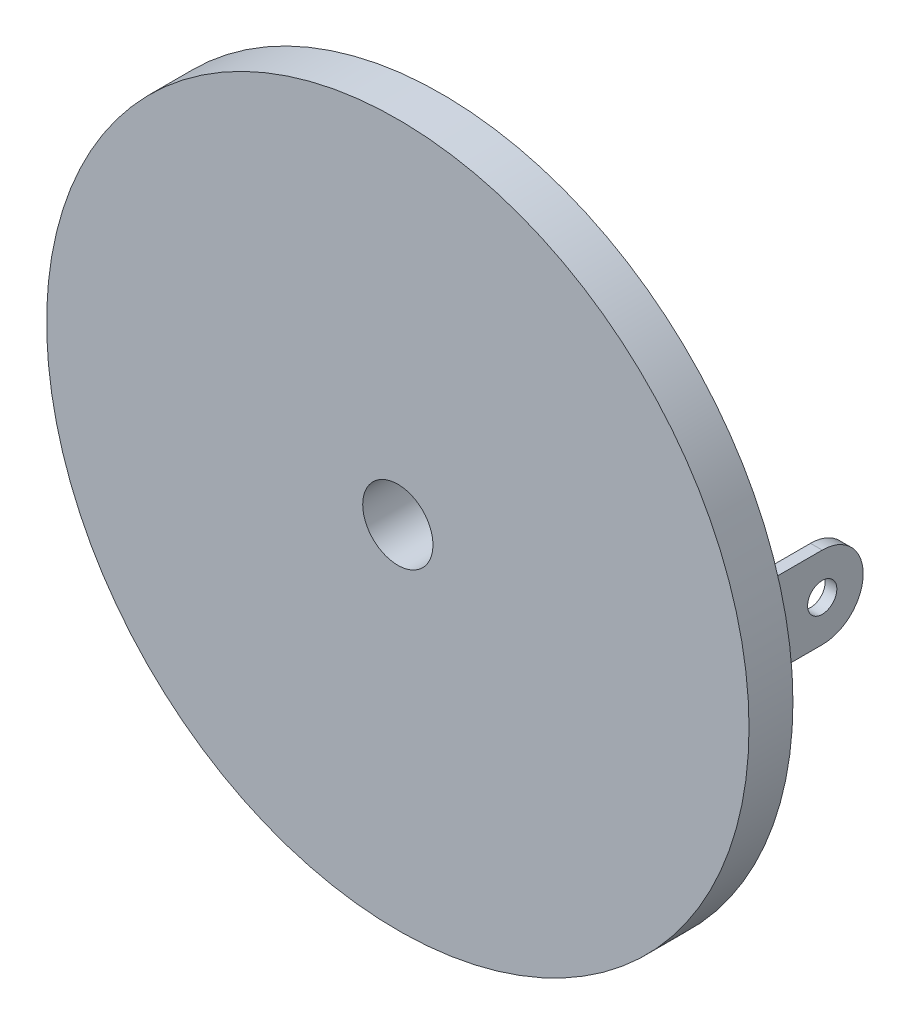
ISO-10303-21;
HEADER;
FILE_DESCRIPTION(('STEP AP214'),'2;1');
FILE_NAME('part.step','',(''),(''),'','','');
FILE_SCHEMA(('AUTOMOTIVE_DESIGN { 1 0 10303 214 1 1 1 1 }'));
ENDSEC;
DATA;
#1=APPLICATION_CONTEXT('core data for automotive mechanical design processes');
#2=APPLICATION_PROTOCOL_DEFINITION('international standard','automotive_design',2000,#1);
#3=PRODUCT_CONTEXT('',#1,'mechanical');
#4=PRODUCT('Part','Part','',(#3));
#5=PRODUCT_RELATED_PRODUCT_CATEGORY('part','',(#4));
#6=PRODUCT_DEFINITION_FORMATION('','',#4);
#7=PRODUCT_DEFINITION_CONTEXT('part definition',#1,'design');
#8=PRODUCT_DEFINITION('design','',#6,#7);
#9=PRODUCT_DEFINITION_SHAPE('','',#8);
#10=(LENGTH_UNIT() NAMED_UNIT(*) SI_UNIT(.MILLI.,.METRE.));
#11=(NAMED_UNIT(*) PLANE_ANGLE_UNIT() SI_UNIT($,.RADIAN.));
#12=(NAMED_UNIT(*) SI_UNIT($,.STERADIAN.) SOLID_ANGLE_UNIT());
#13=UNCERTAINTY_MEASURE_WITH_UNIT(LENGTH_MEASURE(1.E-05),#10,'distance_accuracy_value','');
#14=(GEOMETRIC_REPRESENTATION_CONTEXT(3) GLOBAL_UNCERTAINTY_ASSIGNED_CONTEXT((#13)) GLOBAL_UNIT_ASSIGNED_CONTEXT((#10,
#11,#12)) REPRESENTATION_CONTEXT('',''));
#15=CARTESIAN_POINT('',(0.,0.,0.));
#16=DIRECTION('',(0.,0.,1.));
#17=DIRECTION('',(1.,0.,0.));
#18=AXIS2_PLACEMENT_3D('',#15,#16,#17);
#19=CARTESIAN_POINT('',(0.,0.,0.));
#20=DIRECTION('',(0.,0.,1.));
#21=DIRECTION('',(1.,0.,0.));
#22=AXIS2_PLACEMENT_3D('',#19,#20,#21);
#23=PLANE('',#22);
#24=DIRECTION('',(0.,1.,0.));
#25=VECTOR('',#24,1.);
#26=CARTESIAN_POINT('',(-9.4,1.4,0.));
#27=LINE('',#26,#25);
#28=CARTESIAN_POINT('',(-9.4,-1.4,0.));
#29=VERTEX_POINT('',#28);
#30=CARTESIAN_POINT('',(-9.4,1.4,0.));
#31=VERTEX_POINT('',#30);
#32=EDGE_CURVE('E213',#29,#31,#27,.T.);
#33=ORIENTED_EDGE('',*,*,#32,.F.);
#34=DIRECTION('',(-1.,0.,0.));
#35=VECTOR('',#34,1.);
#36=CARTESIAN_POINT('',(-9.4,-1.4,0.));
#37=LINE('',#36,#35);
#38=CARTESIAN_POINT('',(-9.,-1.4,0.));
#39=VERTEX_POINT('',#38);
#40=EDGE_CURVE('E222',#39,#29,#37,.T.);
#41=ORIENTED_EDGE('',*,*,#40,.F.);
#42=DIRECTION('',(0.,-1.,0.));
#43=VECTOR('',#42,1.);
#44=CARTESIAN_POINT('',(-9.,1.4,0.));
#45=LINE('',#44,#43);
#46=CARTESIAN_POINT('',(-9.,1.4,0.));
#47=VERTEX_POINT('',#46);
#48=EDGE_CURVE('E219',#47,#39,#45,.T.);
#49=ORIENTED_EDGE('',*,*,#48,.F.);
#50=DIRECTION('',(1.,0.,0.));
#51=VECTOR('',#50,1.);
#52=CARTESIAN_POINT('',(-9.4,1.4,0.));
#53=LINE('',#52,#51);
#54=EDGE_CURVE('E216',#31,#47,#53,.T.);
#55=ORIENTED_EDGE('',*,*,#54,.F.);
#56=EDGE_LOOP('',(#33,#41,#49,#55));
#57=FACE_BOUND('',#56,.T.);
#58=CARTESIAN_POINT('',(0.,0.,0.));
#59=DIRECTION('',(0.,0.,1.));
#60=DIRECTION('',(1.,0.,0.));
#61=AXIS2_PLACEMENT_3D('',#58,#59,#60);
#62=CIRCLE('',#61,12.);
#63=CARTESIAN_POINT('',(12.,0.,0.));
#64=VERTEX_POINT('',#63);
#65=EDGE_CURVE('E113',#64,#64,#62,.T.);
#66=ORIENTED_EDGE('',*,*,#65,.F.);
#67=EDGE_LOOP('',(#66));
#68=FACE_BOUND('',#67,.T.);
#69=DIRECTION('',(0.,-1.,0.));
#70=VECTOR('',#69,1.);
#71=CARTESIAN_POINT('',(9.4,1.4,0.));
#72=LINE('',#71,#70);
#73=CARTESIAN_POINT('',(9.4,1.4,0.));
#74=VERTEX_POINT('',#73);
#75=CARTESIAN_POINT('',(9.4,-1.4,0.));
#76=VERTEX_POINT('',#75);
#77=EDGE_CURVE('E112',#74,#76,#72,.T.);
#78=ORIENTED_EDGE('',*,*,#77,.F.);
#79=DIRECTION('',(1.,0.,0.));
#80=VECTOR('',#79,1.);
#81=CARTESIAN_POINT('',(9.4,1.4,0.));
#82=LINE('',#81,#80);
#83=CARTESIAN_POINT('',(9.,1.4,0.));
#84=VERTEX_POINT('',#83);
#85=EDGE_CURVE('E239',#84,#74,#82,.T.);
#86=ORIENTED_EDGE('',*,*,#85,.F.);
#87=DIRECTION('',(0.,1.,0.));
#88=VECTOR('',#87,1.);
#89=CARTESIAN_POINT('',(9.,1.4,0.));
#90=LINE('',#89,#88);
#91=CARTESIAN_POINT('',(9.,-1.4,0.));
#92=VERTEX_POINT('',#91);
#93=EDGE_CURVE('E236',#92,#84,#90,.T.);
#94=ORIENTED_EDGE('',*,*,#93,.F.);
#95=DIRECTION('',(-1.,0.,0.));
#96=VECTOR('',#95,1.);
#97=CARTESIAN_POINT('',(9.4,-1.4,0.));
#98=LINE('',#97,#96);
#99=EDGE_CURVE('E234',#76,#92,#98,.T.);
#100=ORIENTED_EDGE('',*,*,#99,.F.);
#101=EDGE_LOOP('',(#78,#86,#94,#100));
#102=FACE_BOUND('',#101,.T.);
#103=CARTESIAN_POINT('',(0.,0.,0.));
#104=DIRECTION('',(0.,0.,1.));
#105=DIRECTION('',(1.,0.,0.));
#106=AXIS2_PLACEMENT_3D('',#103,#104,#105);
#107=CIRCLE('',#106,4.2);
#108=CARTESIAN_POINT('',(4.2,0.,0.));
#109=VERTEX_POINT('',#108);
#110=EDGE_CURVE('E11',#109,#109,#107,.F.);
#111=ORIENTED_EDGE('',*,*,#110,.F.);
#112=EDGE_LOOP('',(#111));
#113=FACE_BOUND('',#112,.T.);
#114=ADVANCED_FACE('F26',(#57,#68,#102,#113),#23,.F.);
#115=CARTESIAN_POINT('',(0.,0.,1.5));
#116=DIRECTION('',(0.,0.,-1.));
#117=DIRECTION('',(-1.,0.,0.));
#118=AXIS2_PLACEMENT_3D('',#115,#116,#117);
#119=CYLINDRICAL_SURFACE('',#118,12.);
#120=CARTESIAN_POINT('',(0.,0.,1.5));
#121=DIRECTION('',(0.,0.,1.));
#122=DIRECTION('',(1.,0.,0.));
#123=AXIS2_PLACEMENT_3D('',#120,#121,#122);
#124=CIRCLE('',#123,12.);
#125=CARTESIAN_POINT('',(12.,0.,1.5));
#126=VERTEX_POINT('',#125);
#127=EDGE_CURVE('E35',#126,#126,#124,.T.);
#128=ORIENTED_EDGE('',*,*,#127,.F.);
#129=EDGE_LOOP('',(#128));
#130=FACE_BOUND('',#129,.T.);
#131=ORIENTED_EDGE('',*,*,#65,.T.);
#132=EDGE_LOOP('',(#131));
#133=FACE_BOUND('',#132,.T.);
#134=ADVANCED_FACE('F28',(#130,#133),#119,.T.);
#135=CARTESIAN_POINT('',(0.,0.,1.5));
#136=DIRECTION('',(0.,0.,1.));
#137=DIRECTION('',(1.,0.,0.));
#138=AXIS2_PLACEMENT_3D('',#135,#136,#137);
#139=PLANE('',#138);
#140=CARTESIAN_POINT('',(0.,0.,1.5));
#141=DIRECTION('',(0.,0.,-1.));
#142=DIRECTION('',(-1.,0.,0.));
#143=AXIS2_PLACEMENT_3D('',#140,#141,#142);
#144=CIRCLE('',#143,1.2);
#145=CARTESIAN_POINT('',(-1.2,0.,1.5));
#146=VERTEX_POINT('',#145);
#147=EDGE_CURVE('E98',#146,#146,#144,.T.);
#148=ORIENTED_EDGE('',*,*,#147,.T.);
#149=EDGE_LOOP('',(#148));
#150=FACE_BOUND('',#149,.T.);
#151=ORIENTED_EDGE('',*,*,#127,.T.);
#152=EDGE_LOOP('',(#151));
#153=FACE_BOUND('',#152,.T.);
#154=ADVANCED_FACE('F124',(#150,#153),#139,.T.);
#155=CARTESIAN_POINT('',(9.4,1.4,-5.));
#156=DIRECTION('',(-1.,0.,0.));
#157=DIRECTION('',(0.,0.,1.));
#158=AXIS2_PLACEMENT_3D('',#155,#156,#157);
#159=PLANE('',#158);
#160=CARTESIAN_POINT('',(9.4,0.,-3.6));
#161=DIRECTION('',(1.,0.,0.));
#162=DIRECTION('',(0.,0.,-1.));
#163=AXIS2_PLACEMENT_3D('',#160,#161,#162);
#164=CIRCLE('',#163,0.500000000000001);
#165=CARTESIAN_POINT('',(9.4,0.,-4.1));
#166=VERTEX_POINT('',#165);
#167=EDGE_CURVE('E201',#166,#166,#164,.T.);
#168=ORIENTED_EDGE('',*,*,#167,.F.);
#169=EDGE_LOOP('',(#168));
#170=FACE_BOUND('',#169,.T.);
#171=DIRECTION('',(0.,0.,1.));
#172=VECTOR('',#171,1.);
#173=CARTESIAN_POINT('',(9.4,-1.4,-5.));
#174=LINE('',#173,#172);
#175=CARTESIAN_POINT('',(9.4,-1.4,-3.6));
#176=VERTEX_POINT('',#175);
#177=EDGE_CURVE('E104',#176,#76,#174,.T.);
#178=ORIENTED_EDGE('',*,*,#177,.F.);
#179=CARTESIAN_POINT('',(9.4,0.,-3.6));
#180=DIRECTION('',(-1.,0.,0.));
#181=DIRECTION('',(0.,0.,-1.));
#182=AXIS2_PLACEMENT_3D('',#179,#180,#181);
#183=CIRCLE('',#182,1.4);
#184=CARTESIAN_POINT('',(9.4,1.4,-3.6));
#185=VERTEX_POINT('',#184);
#186=EDGE_CURVE('E90',#185,#176,#183,.T.);
#187=ORIENTED_EDGE('',*,*,#186,.F.);
#188=DIRECTION('',(0.,0.,1.));
#189=VECTOR('',#188,1.);
#190=CARTESIAN_POINT('',(9.4,1.4,-5.));
#191=LINE('',#190,#189);
#192=EDGE_CURVE('E241',#185,#74,#191,.T.);
#193=ORIENTED_EDGE('',*,*,#192,.T.);
#194=ORIENTED_EDGE('',*,*,#77,.T.);
#195=EDGE_LOOP('',(#178,#187,#193,#194));
#196=FACE_BOUND('',#195,.T.);
#197=ADVANCED_FACE('F110',(#170,#196),#159,.F.);
#198=CARTESIAN_POINT('',(9.4,-1.4,-5.));
#199=DIRECTION('',(0.,1.,0.));
#200=DIRECTION('',(0.,0.,1.));
#201=AXIS2_PLACEMENT_3D('',#198,#199,#200);
#202=PLANE('',#201);
#203=DIRECTION('',(0.,0.,1.));
#204=VECTOR('',#203,1.);
#205=CARTESIAN_POINT('',(9.,-1.4,-5.));
#206=LINE('',#205,#204);
#207=CARTESIAN_POINT('',(9.,-1.4,-3.6));
#208=VERTEX_POINT('',#207);
#209=EDGE_CURVE('E106',#208,#92,#206,.T.);
#210=ORIENTED_EDGE('',*,*,#209,.F.);
#211=DIRECTION('',(1.,0.,0.));
#212=VECTOR('',#211,1.);
#213=CARTESIAN_POINT('',(-12.,-1.4,-3.6));
#214=LINE('',#213,#212);
#215=EDGE_CURVE('E93',#208,#176,#214,.T.);
#216=ORIENTED_EDGE('',*,*,#215,.T.);
#217=ORIENTED_EDGE('',*,*,#177,.T.);
#218=ORIENTED_EDGE('',*,*,#99,.T.);
#219=EDGE_LOOP('',(#210,#216,#217,#218));
#220=FACE_BOUND('',#219,.T.);
#221=ADVANCED_FACE('F102',(#220),#202,.F.);
#222=CARTESIAN_POINT('',(9.,1.4,-5.));
#223=DIRECTION('',(1.,0.,0.));
#224=DIRECTION('',(0.,0.,-1.));
#225=AXIS2_PLACEMENT_3D('',#222,#223,#224);
#226=PLANE('',#225);
#227=CARTESIAN_POINT('',(9.,0.,-3.6));
#228=DIRECTION('',(1.,0.,0.));
#229=DIRECTION('',(0.,0.,-1.));
#230=AXIS2_PLACEMENT_3D('',#227,#228,#229);
#231=CIRCLE('',#230,0.500000000000001);
#232=CARTESIAN_POINT('',(9.,0.,-4.1));
#233=VERTEX_POINT('',#232);
#234=EDGE_CURVE('E207',#233,#233,#231,.T.);
#235=ORIENTED_EDGE('',*,*,#234,.T.);
#236=EDGE_LOOP('',(#235));
#237=FACE_BOUND('',#236,.T.);
#238=DIRECTION('',(0.,0.,1.));
#239=VECTOR('',#238,1.);
#240=CARTESIAN_POINT('',(9.,1.4,-5.));
#241=LINE('',#240,#239);
#242=CARTESIAN_POINT('',(9.,1.4,-3.6));
#243=VERTEX_POINT('',#242);
#244=EDGE_CURVE('E117',#243,#84,#241,.T.);
#245=ORIENTED_EDGE('',*,*,#244,.F.);
#246=CARTESIAN_POINT('',(9.,0.,-3.6));
#247=DIRECTION('',(1.,0.,0.));
#248=DIRECTION('',(0.,0.,-1.));
#249=AXIS2_PLACEMENT_3D('',#246,#247,#248);
#250=CIRCLE('',#249,1.4);
#251=EDGE_CURVE('E42',#243,#208,#250,.F.);
#252=ORIENTED_EDGE('',*,*,#251,.T.);
#253=ORIENTED_EDGE('',*,*,#209,.T.);
#254=ORIENTED_EDGE('',*,*,#93,.T.);
#255=EDGE_LOOP('',(#245,#252,#253,#254));
#256=FACE_BOUND('',#255,.T.);
#257=ADVANCED_FACE('F173',(#237,#256),#226,.F.);
#258=CARTESIAN_POINT('',(9.4,1.4,-5.));
#259=DIRECTION('',(0.,-1.,0.));
#260=DIRECTION('',(0.,0.,-1.));
#261=AXIS2_PLACEMENT_3D('',#258,#259,#260);
#262=PLANE('',#261);
#263=ORIENTED_EDGE('',*,*,#192,.F.);
#264=DIRECTION('',(1.,0.,0.));
#265=VECTOR('',#264,1.);
#266=CARTESIAN_POINT('',(-12.,1.4,-3.6));
#267=LINE('',#266,#265);
#268=EDGE_CURVE('E94',#243,#185,#267,.T.);
#269=ORIENTED_EDGE('',*,*,#268,.F.);
#270=ORIENTED_EDGE('',*,*,#244,.T.);
#271=ORIENTED_EDGE('',*,*,#85,.T.);
#272=EDGE_LOOP('',(#263,#269,#270,#271));
#273=FACE_BOUND('',#272,.T.);
#274=ADVANCED_FACE('F169',(#273),#262,.F.);
#275=CARTESIAN_POINT('',(-9.4,1.4,-5.));
#276=DIRECTION('',(1.,0.,0.));
#277=DIRECTION('',(0.,0.,-1.));
#278=AXIS2_PLACEMENT_3D('',#275,#276,#277);
#279=PLANE('',#278);
#280=CARTESIAN_POINT('',(-9.4,0.,-3.6));
#281=DIRECTION('',(1.,0.,0.));
#282=DIRECTION('',(0.,0.,-1.));
#283=AXIS2_PLACEMENT_3D('',#280,#281,#282);
#284=CIRCLE('',#283,0.500000000000001);
#285=CARTESIAN_POINT('',(-9.4,0.,-4.1));
#286=VERTEX_POINT('',#285);
#287=EDGE_CURVE('E204',#286,#286,#284,.T.);
#288=ORIENTED_EDGE('',*,*,#287,.T.);
#289=EDGE_LOOP('',(#288));
#290=FACE_BOUND('',#289,.T.);
#291=DIRECTION('',(0.,0.,1.));
#292=VECTOR('',#291,1.);
#293=CARTESIAN_POINT('',(-9.4,1.4,-5.));
#294=LINE('',#293,#292);
#295=CARTESIAN_POINT('',(-9.4,1.4,-3.6));
#296=VERTEX_POINT('',#295);
#297=EDGE_CURVE('E231',#296,#31,#294,.T.);
#298=ORIENTED_EDGE('',*,*,#297,.F.);
#299=CARTESIAN_POINT('',(-9.4,0.,-3.6));
#300=DIRECTION('',(1.,0.,0.));
#301=DIRECTION('',(0.,0.,-1.));
#302=AXIS2_PLACEMENT_3D('',#299,#300,#301);
#303=CIRCLE('',#302,1.4);
#304=CARTESIAN_POINT('',(-9.4,-1.4,-3.6));
#305=VERTEX_POINT('',#304);
#306=EDGE_CURVE('E197',#296,#305,#303,.F.);
#307=ORIENTED_EDGE('',*,*,#306,.T.);
#308=DIRECTION('',(0.,0.,1.));
#309=VECTOR('',#308,1.);
#310=CARTESIAN_POINT('',(-9.4,-1.4,-5.));
#311=LINE('',#310,#309);
#312=EDGE_CURVE('E225',#305,#29,#311,.T.);
#313=ORIENTED_EDGE('',*,*,#312,.T.);
#314=ORIENTED_EDGE('',*,*,#32,.T.);
#315=EDGE_LOOP('',(#298,#307,#313,#314));
#316=FACE_BOUND('',#315,.T.);
#317=ADVANCED_FACE('F165',(#290,#316),#279,.F.);
#318=CARTESIAN_POINT('',(-9.4,1.4,-5.));
#319=DIRECTION('',(0.,-1.,0.));
#320=DIRECTION('',(0.,0.,-1.));
#321=AXIS2_PLACEMENT_3D('',#318,#319,#320);
#322=PLANE('',#321);
#323=DIRECTION('',(0.,0.,1.));
#324=VECTOR('',#323,1.);
#325=CARTESIAN_POINT('',(-9.,1.4,-5.));
#326=LINE('',#325,#324);
#327=CARTESIAN_POINT('',(-9.,1.4,-3.6));
#328=VERTEX_POINT('',#327);
#329=EDGE_CURVE('E229',#328,#47,#326,.T.);
#330=ORIENTED_EDGE('',*,*,#329,.F.);
#331=EDGE_CURVE('E194',#296,#328,#267,.T.);
#332=ORIENTED_EDGE('',*,*,#331,.F.);
#333=ORIENTED_EDGE('',*,*,#297,.T.);
#334=ORIENTED_EDGE('',*,*,#54,.T.);
#335=EDGE_LOOP('',(#330,#332,#333,#334));
#336=FACE_BOUND('',#335,.T.);
#337=ADVANCED_FACE('F161',(#336),#322,.F.);
#338=CARTESIAN_POINT('',(-9.,1.4,-5.));
#339=DIRECTION('',(-1.,0.,0.));
#340=DIRECTION('',(0.,0.,1.));
#341=AXIS2_PLACEMENT_3D('',#338,#339,#340);
#342=PLANE('',#341);
#343=CARTESIAN_POINT('',(-9.,0.,-3.6));
#344=DIRECTION('',(-1.,0.,0.));
#345=DIRECTION('',(0.,0.,1.));
#346=AXIS2_PLACEMENT_3D('',#343,#344,#345);
#347=CIRCLE('',#346,0.500000000000001);
#348=CARTESIAN_POINT('',(-9.,0.,-3.1));
#349=VERTEX_POINT('',#348);
#350=EDGE_CURVE('E30',#349,#349,#347,.T.);
#351=ORIENTED_EDGE('',*,*,#350,.T.);
#352=EDGE_LOOP('',(#351));
#353=FACE_BOUND('',#352,.T.);
#354=DIRECTION('',(0.,0.,1.));
#355=VECTOR('',#354,1.);
#356=CARTESIAN_POINT('',(-9.,-1.4,-5.));
#357=LINE('',#356,#355);
#358=CARTESIAN_POINT('',(-9.,-1.4,-3.6));
#359=VERTEX_POINT('',#358);
#360=EDGE_CURVE('E227',#359,#39,#357,.T.);
#361=ORIENTED_EDGE('',*,*,#360,.F.);
#362=CARTESIAN_POINT('',(-9.,0.,-3.6));
#363=DIRECTION('',(-1.,0.,0.));
#364=DIRECTION('',(0.,0.,1.));
#365=AXIS2_PLACEMENT_3D('',#362,#363,#364);
#366=CIRCLE('',#365,1.4);
#367=EDGE_CURVE('E50',#359,#328,#366,.F.);
#368=ORIENTED_EDGE('',*,*,#367,.T.);
#369=ORIENTED_EDGE('',*,*,#329,.T.);
#370=ORIENTED_EDGE('',*,*,#48,.T.);
#371=EDGE_LOOP('',(#361,#368,#369,#370));
#372=FACE_BOUND('',#371,.T.);
#373=ADVANCED_FACE('F153',(#353,#372),#342,.F.);
#374=CARTESIAN_POINT('',(-9.4,-1.4,-5.));
#375=DIRECTION('',(0.,1.,0.));
#376=DIRECTION('',(0.,0.,1.));
#377=AXIS2_PLACEMENT_3D('',#374,#375,#376);
#378=PLANE('',#377);
#379=ORIENTED_EDGE('',*,*,#312,.F.);
#380=EDGE_CURVE('E107',#305,#359,#214,.T.);
#381=ORIENTED_EDGE('',*,*,#380,.T.);
#382=ORIENTED_EDGE('',*,*,#360,.T.);
#383=ORIENTED_EDGE('',*,*,#40,.T.);
#384=EDGE_LOOP('',(#379,#381,#382,#383));
#385=FACE_BOUND('',#384,.T.);
#386=ADVANCED_FACE('F142',(#385),#378,.F.);
#387=CARTESIAN_POINT('',(0.,0.,-2.));
#388=DIRECTION('',(0.,0.,1.));
#389=DIRECTION('',(1.,0.,0.));
#390=AXIS2_PLACEMENT_3D('',#387,#388,#389);
#391=CYLINDRICAL_SURFACE('',#390,4.2);
#392=CARTESIAN_POINT('',(0.,0.,-2.));
#393=DIRECTION('',(0.,0.,-1.));
#394=DIRECTION('',(-1.,0.,0.));
#395=AXIS2_PLACEMENT_3D('',#392,#393,#394);
#396=CIRCLE('',#395,4.2);
#397=CARTESIAN_POINT('',(-4.2,0.,-2.));
#398=VERTEX_POINT('',#397);
#399=EDGE_CURVE('E210',#398,#398,#396,.T.);
#400=ORIENTED_EDGE('',*,*,#399,.F.);
#401=EDGE_LOOP('',(#400));
#402=FACE_BOUND('',#401,.T.);
#403=ORIENTED_EDGE('',*,*,#110,.T.);
#404=EDGE_LOOP('',(#403));
#405=FACE_BOUND('',#404,.T.);
#406=ADVANCED_FACE('F139',(#402,#405),#391,.T.);
#407=CARTESIAN_POINT('',(0.,0.,-2.));
#408=DIRECTION('',(0.,0.,-1.));
#409=DIRECTION('',(-1.,0.,0.));
#410=AXIS2_PLACEMENT_3D('',#407,#408,#409);
#411=PLANE('',#410);
#412=CARTESIAN_POINT('',(0.,0.,-2.));
#413=DIRECTION('',(0.,0.,-1.));
#414=DIRECTION('',(-1.,0.,0.));
#415=AXIS2_PLACEMENT_3D('',#412,#413,#414);
#416=CIRCLE('',#415,1.2);
#417=CARTESIAN_POINT('',(-1.2,0.,-2.));
#418=VERTEX_POINT('',#417);
#419=EDGE_CURVE('E189',#418,#418,#416,.T.);
#420=ORIENTED_EDGE('',*,*,#419,.F.);
#421=EDGE_LOOP('',(#420));
#422=FACE_BOUND('',#421,.T.);
#423=ORIENTED_EDGE('',*,*,#399,.T.);
#424=EDGE_LOOP('',(#423));
#425=FACE_BOUND('',#424,.T.);
#426=ADVANCED_FACE('F141',(#422,#425),#411,.T.);
#427=CARTESIAN_POINT('',(-12.,0.,-3.6));
#428=DIRECTION('',(1.,0.,0.));
#429=DIRECTION('',(0.,0.,-1.));
#430=AXIS2_PLACEMENT_3D('',#427,#428,#429);
#431=CYLINDRICAL_SURFACE('',#430,0.500000000000001);
#432=ORIENTED_EDGE('',*,*,#350,.F.);
#433=EDGE_LOOP('',(#432));
#434=FACE_BOUND('',#433,.T.);
#435=ORIENTED_EDGE('',*,*,#287,.F.);
#436=EDGE_LOOP('',(#435));
#437=FACE_BOUND('',#436,.T.);
#438=ADVANCED_FACE('F149',(#434,#437),#431,.F.);
#439=ORIENTED_EDGE('',*,*,#167,.T.);
#440=EDGE_LOOP('',(#439));
#441=FACE_BOUND('',#440,.T.);
#442=ORIENTED_EDGE('',*,*,#234,.F.);
#443=EDGE_LOOP('',(#442));
#444=FACE_BOUND('',#443,.T.);
#445=ADVANCED_FACE('F258',(#441,#444),#431,.F.);
#446=CARTESIAN_POINT('',(-12.,0.,-3.6));
#447=DIRECTION('',(1.,0.,0.));
#448=DIRECTION('',(0.,0.,-1.));
#449=AXIS2_PLACEMENT_3D('',#446,#447,#448);
#450=CYLINDRICAL_SURFACE('',#449,1.4);
#451=ORIENTED_EDGE('',*,*,#306,.F.);
#452=ORIENTED_EDGE('',*,*,#331,.T.);
#453=ORIENTED_EDGE('',*,*,#367,.F.);
#454=ORIENTED_EDGE('',*,*,#380,.F.);
#455=EDGE_LOOP('',(#451,#452,#453,#454));
#456=FACE_BOUND('',#455,.T.);
#457=ADVANCED_FACE('F256',(#456),#450,.T.);
#458=ORIENTED_EDGE('',*,*,#251,.F.);
#459=ORIENTED_EDGE('',*,*,#268,.T.);
#460=ORIENTED_EDGE('',*,*,#186,.T.);
#461=ORIENTED_EDGE('',*,*,#215,.F.);
#462=EDGE_LOOP('',(#458,#459,#460,#461));
#463=FACE_BOUND('',#462,.T.);
#464=ADVANCED_FACE('F92',(#463),#450,.T.);
#465=CARTESIAN_POINT('',(0.,0.,1.5));
#466=DIRECTION('',(0.,0.,-1.));
#467=DIRECTION('',(-1.,0.,0.));
#468=AXIS2_PLACEMENT_3D('',#465,#466,#467);
#469=CYLINDRICAL_SURFACE('',#468,1.2);
#470=ORIENTED_EDGE('',*,*,#147,.F.);
#471=EDGE_LOOP('',(#470));
#472=FACE_BOUND('',#471,.T.);
#473=ORIENTED_EDGE('',*,*,#419,.T.);
#474=EDGE_LOOP('',(#473));
#475=FACE_BOUND('',#474,.T.);
#476=ADVANCED_FACE('F263',(#472,#475),#469,.F.);
#477=CLOSED_SHELL('',(#114,#134,#154,#197,#221,#257,#274,#317,#337,#373,#386,#406,#426,#438,
#445,#457,#464,#476));
#478=MANIFOLD_SOLID_BREP('B2',#477);
#479=ADVANCED_BREP_SHAPE_REPRESENTATION('',(#18,#478),#14);
#480=SHAPE_DEFINITION_REPRESENTATION(#9,#479);
ENDSEC;
END-ISO-10303-21;
